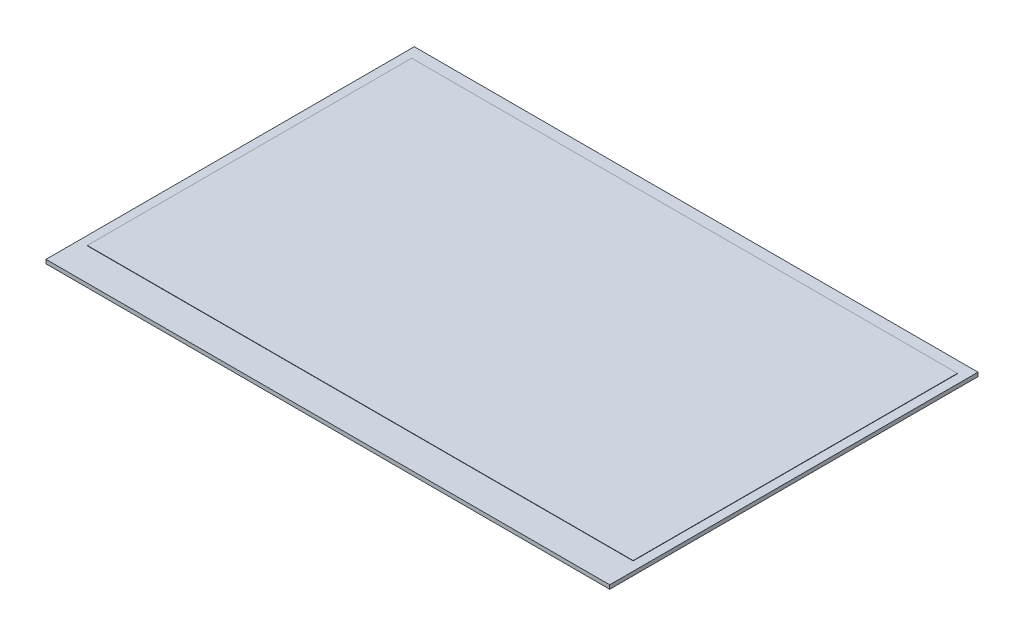
ISO-10303-21;
HEADER;
FILE_DESCRIPTION(('STEP AP214'),'2;1');
FILE_NAME('part.step','',(''),(''),'','','');
FILE_SCHEMA(('AUTOMOTIVE_DESIGN { 1 0 10303 214 1 1 1 1 }'));
ENDSEC;
DATA;
#1=APPLICATION_CONTEXT('core data for automotive mechanical design processes');
#2=APPLICATION_PROTOCOL_DEFINITION('international standard','automotive_design',2000,#1);
#3=PRODUCT_CONTEXT('',#1,'mechanical');
#4=PRODUCT('Part','Part','',(#3));
#5=PRODUCT_RELATED_PRODUCT_CATEGORY('part','',(#4));
#6=PRODUCT_DEFINITION_FORMATION('','',#4);
#7=PRODUCT_DEFINITION_CONTEXT('part definition',#1,'design');
#8=PRODUCT_DEFINITION('design','',#6,#7);
#9=PRODUCT_DEFINITION_SHAPE('','',#8);
#10=(LENGTH_UNIT() NAMED_UNIT(*) SI_UNIT(.MILLI.,.METRE.));
#11=(NAMED_UNIT(*) PLANE_ANGLE_UNIT() SI_UNIT($,.RADIAN.));
#12=(NAMED_UNIT(*) SI_UNIT($,.STERADIAN.) SOLID_ANGLE_UNIT());
#13=UNCERTAINTY_MEASURE_WITH_UNIT(LENGTH_MEASURE(1.E-05),#10,'distance_accuracy_value','');
#14=(GEOMETRIC_REPRESENTATION_CONTEXT(3) GLOBAL_UNCERTAINTY_ASSIGNED_CONTEXT((#13)) GLOBAL_UNIT_ASSIGNED_CONTEXT((#10,
#11,#12)) REPRESENTATION_CONTEXT('',''));
#15=CARTESIAN_POINT('',(0.,0.,0.));
#16=DIRECTION('',(0.,0.,1.));
#17=DIRECTION('',(1.,0.,0.));
#18=AXIS2_PLACEMENT_3D('',#15,#16,#17);
#19=CARTESIAN_POINT('',(85.1,1.18,-55.6));
#20=DIRECTION('',(-1.,0.,0.));
#21=DIRECTION('',(0.,0.,1.));
#22=AXIS2_PLACEMENT_3D('',#19,#20,#21);
#23=PLANE('',#22);
#24=DIRECTION('',(0.,0.,-1.));
#25=VECTOR('',#24,1.);
#26=CARTESIAN_POINT('',(85.1,0.,-55.6));
#27=LINE('',#26,#25);
#28=CARTESIAN_POINT('',(85.1,0.,55.6));
#29=VERTEX_POINT('',#28);
#30=CARTESIAN_POINT('',(85.1,0.,-55.6));
#31=VERTEX_POINT('',#30);
#32=EDGE_CURVE('E117',#29,#31,#27,.T.);
#33=ORIENTED_EDGE('',*,*,#32,.T.);
#34=DIRECTION('',(0.,-1.,0.));
#35=VECTOR('',#34,1.);
#36=CARTESIAN_POINT('',(85.1,1.18,-55.6));
#37=LINE('',#36,#35);
#38=CARTESIAN_POINT('',(85.1,1.18,-55.6));
#39=VERTEX_POINT('',#38);
#40=EDGE_CURVE('E11',#39,#31,#37,.T.);
#41=ORIENTED_EDGE('',*,*,#40,.F.);
#42=DIRECTION('',(0.,0.,-1.));
#43=VECTOR('',#42,1.);
#44=CARTESIAN_POINT('',(85.1,1.18,-55.6));
#45=LINE('',#44,#43);
#46=CARTESIAN_POINT('',(85.1,1.18,55.6));
#47=VERTEX_POINT('',#46);
#48=EDGE_CURVE('E126',#47,#39,#45,.T.);
#49=ORIENTED_EDGE('',*,*,#48,.F.);
#50=DIRECTION('',(0.,-1.,0.));
#51=VECTOR('',#50,1.);
#52=CARTESIAN_POINT('',(85.1,1.18,55.6));
#53=LINE('',#52,#51);
#54=EDGE_CURVE('E135',#47,#29,#53,.T.);
#55=ORIENTED_EDGE('',*,*,#54,.T.);
#56=EDGE_LOOP('',(#33,#41,#49,#55));
#57=FACE_BOUND('',#56,.T.);
#58=ADVANCED_FACE('F33',(#57),#23,.F.);
#59=CARTESIAN_POINT('',(-85.1,1.18,-55.6));
#60=DIRECTION('',(0.,0.,1.));
#61=DIRECTION('',(1.,0.,0.));
#62=AXIS2_PLACEMENT_3D('',#59,#60,#61);
#63=PLANE('',#62);
#64=DIRECTION('',(-1.,0.,0.));
#65=VECTOR('',#64,1.);
#66=CARTESIAN_POINT('',(-85.1,0.,-55.6));
#67=LINE('',#66,#65);
#68=CARTESIAN_POINT('',(-85.1,0.,-55.6));
#69=VERTEX_POINT('',#68);
#70=EDGE_CURVE('E120',#31,#69,#67,.T.);
#71=ORIENTED_EDGE('',*,*,#70,.T.);
#72=DIRECTION('',(0.,-1.,0.));
#73=VECTOR('',#72,1.);
#74=CARTESIAN_POINT('',(-85.1,1.18,-55.6));
#75=LINE('',#74,#73);
#76=CARTESIAN_POINT('',(-85.1,1.18,-55.6));
#77=VERTEX_POINT('',#76);
#78=EDGE_CURVE('E40',#77,#69,#75,.T.);
#79=ORIENTED_EDGE('',*,*,#78,.F.);
#80=DIRECTION('',(-1.,0.,0.));
#81=VECTOR('',#80,1.);
#82=CARTESIAN_POINT('',(-85.1,1.18,-55.6));
#83=LINE('',#82,#81);
#84=EDGE_CURVE('E129',#39,#77,#83,.T.);
#85=ORIENTED_EDGE('',*,*,#84,.F.);
#86=ORIENTED_EDGE('',*,*,#40,.T.);
#87=EDGE_LOOP('',(#71,#79,#85,#86));
#88=FACE_BOUND('',#87,.T.);
#89=ADVANCED_FACE('F166',(#88),#63,.F.);
#90=CARTESIAN_POINT('',(-85.1,1.18,-55.6));
#91=DIRECTION('',(1.,0.,0.));
#92=DIRECTION('',(0.,0.,-1.));
#93=AXIS2_PLACEMENT_3D('',#90,#91,#92);
#94=PLANE('',#93);
#95=DIRECTION('',(0.,0.,1.));
#96=VECTOR('',#95,1.);
#97=CARTESIAN_POINT('',(-85.1,0.,-55.6));
#98=LINE('',#97,#96);
#99=CARTESIAN_POINT('',(-85.1,0.,55.6));
#100=VERTEX_POINT('',#99);
#101=EDGE_CURVE('E138',#69,#100,#98,.T.);
#102=ORIENTED_EDGE('',*,*,#101,.T.);
#103=DIRECTION('',(0.,-1.,0.));
#104=VECTOR('',#103,1.);
#105=CARTESIAN_POINT('',(-85.1,1.18,55.6));
#106=LINE('',#105,#104);
#107=CARTESIAN_POINT('',(-85.1,1.18,55.6));
#108=VERTEX_POINT('',#107);
#109=EDGE_CURVE('E143',#108,#100,#106,.T.);
#110=ORIENTED_EDGE('',*,*,#109,.F.);
#111=DIRECTION('',(0.,0.,1.));
#112=VECTOR('',#111,1.);
#113=CARTESIAN_POINT('',(-85.1,1.18,-55.6));
#114=LINE('',#113,#112);
#115=EDGE_CURVE('E132',#77,#108,#114,.T.);
#116=ORIENTED_EDGE('',*,*,#115,.F.);
#117=ORIENTED_EDGE('',*,*,#78,.T.);
#118=EDGE_LOOP('',(#102,#110,#116,#117));
#119=FACE_BOUND('',#118,.T.);
#120=ADVANCED_FACE('F150',(#119),#94,.F.);
#121=CARTESIAN_POINT('',(-85.1,1.18,55.6));
#122=DIRECTION('',(0.,0.,-1.));
#123=DIRECTION('',(-1.,0.,0.));
#124=AXIS2_PLACEMENT_3D('',#121,#122,#123);
#125=PLANE('',#124);
#126=DIRECTION('',(1.,0.,0.));
#127=VECTOR('',#126,1.);
#128=CARTESIAN_POINT('',(-85.1,0.,55.6));
#129=LINE('',#128,#127);
#130=EDGE_CURVE('E130',#100,#29,#129,.T.);
#131=ORIENTED_EDGE('',*,*,#130,.T.);
#132=ORIENTED_EDGE('',*,*,#54,.F.);
#133=DIRECTION('',(1.,0.,0.));
#134=VECTOR('',#133,1.);
#135=CARTESIAN_POINT('',(-85.1,1.18,55.6));
#136=LINE('',#135,#134);
#137=EDGE_CURVE('E134',#108,#47,#136,.T.);
#138=ORIENTED_EDGE('',*,*,#137,.F.);
#139=ORIENTED_EDGE('',*,*,#109,.T.);
#140=EDGE_LOOP('',(#131,#132,#138,#139));
#141=FACE_BOUND('',#140,.T.);
#142=ADVANCED_FACE('F159',(#141),#125,.F.);
#143=CARTESIAN_POINT('',(0.,1.18,0.));
#144=DIRECTION('',(0.,1.,0.));
#145=DIRECTION('',(0.,0.,1.));
#146=AXIS2_PLACEMENT_3D('',#143,#144,#145);
#147=PLANE('',#146);
#148=DIRECTION('',(0.,0.,-1.));
#149=VECTOR('',#148,1.);
#150=CARTESIAN_POINT('',(82.4,1.18,-52.1));
#151=LINE('',#150,#149);
#152=CARTESIAN_POINT('',(82.4,1.18,45.82));
#153=VERTEX_POINT('',#152);
#154=CARTESIAN_POINT('',(82.4,1.18,-52.1));
#155=VERTEX_POINT('',#154);
#156=EDGE_CURVE('E47',#153,#155,#151,.T.);
#157=ORIENTED_EDGE('',*,*,#156,.F.);
#158=DIRECTION('',(1.,0.,0.));
#159=VECTOR('',#158,1.);
#160=CARTESIAN_POINT('',(-82.4,1.18,45.82));
#161=LINE('',#160,#159);
#162=CARTESIAN_POINT('',(-82.4,1.18,45.82));
#163=VERTEX_POINT('',#162);
#164=EDGE_CURVE('E51',#163,#153,#161,.T.);
#165=ORIENTED_EDGE('',*,*,#164,.F.);
#166=DIRECTION('',(0.,0.,1.));
#167=VECTOR('',#166,1.);
#168=CARTESIAN_POINT('',(-82.4,1.18,-52.1));
#169=LINE('',#168,#167);
#170=CARTESIAN_POINT('',(-82.4,1.18,-52.1));
#171=VERTEX_POINT('',#170);
#172=EDGE_CURVE('E260',#171,#163,#169,.T.);
#173=ORIENTED_EDGE('',*,*,#172,.F.);
#174=DIRECTION('',(-1.,0.,0.));
#175=VECTOR('',#174,1.);
#176=CARTESIAN_POINT('',(-82.4,1.18,-52.1));
#177=LINE('',#176,#175);
#178=EDGE_CURVE('E266',#155,#171,#177,.T.);
#179=ORIENTED_EDGE('',*,*,#178,.F.);
#180=EDGE_LOOP('',(#157,#165,#173,#179));
#181=FACE_BOUND('',#180,.T.);
#182=ORIENTED_EDGE('',*,*,#48,.T.);
#183=ORIENTED_EDGE('',*,*,#84,.T.);
#184=ORIENTED_EDGE('',*,*,#115,.T.);
#185=ORIENTED_EDGE('',*,*,#137,.T.);
#186=EDGE_LOOP('',(#182,#183,#184,#185));
#187=FACE_BOUND('',#186,.T.);
#188=ADVANCED_FACE('F165',(#181,#187),#147,.T.);
#189=CARTESIAN_POINT('',(0.,0.,0.));
#190=DIRECTION('',(0.,1.,0.));
#191=DIRECTION('',(0.,0.,1.));
#192=AXIS2_PLACEMENT_3D('',#189,#190,#191);
#193=PLANE('',#192);
#194=ORIENTED_EDGE('',*,*,#32,.F.);
#195=ORIENTED_EDGE('',*,*,#130,.F.);
#196=ORIENTED_EDGE('',*,*,#101,.F.);
#197=ORIENTED_EDGE('',*,*,#70,.F.);
#198=EDGE_LOOP('',(#194,#195,#196,#197));
#199=FACE_BOUND('',#198,.T.);
#200=ADVANCED_FACE('F156',(#199),#193,.F.);
#201=CARTESIAN_POINT('',(82.4,1.28,-52.1));
#202=DIRECTION('',(-1.,0.,0.));
#203=DIRECTION('',(0.,0.,1.));
#204=AXIS2_PLACEMENT_3D('',#201,#202,#203);
#205=PLANE('',#204);
#206=ORIENTED_EDGE('',*,*,#156,.T.);
#207=DIRECTION('',(0.,-1.,0.));
#208=VECTOR('',#207,1.);
#209=CARTESIAN_POINT('',(82.4,1.28,-52.1));
#210=LINE('',#209,#208);
#211=CARTESIAN_POINT('',(82.4,1.28,-52.1));
#212=VERTEX_POINT('',#211);
#213=EDGE_CURVE('E100',#212,#155,#210,.T.);
#214=ORIENTED_EDGE('',*,*,#213,.F.);
#215=DIRECTION('',(0.,0.,-1.));
#216=VECTOR('',#215,1.);
#217=CARTESIAN_POINT('',(82.4,1.28,-52.1));
#218=LINE('',#217,#216);
#219=CARTESIAN_POINT('',(82.4,1.28,45.82));
#220=VERTEX_POINT('',#219);
#221=EDGE_CURVE('E106',#220,#212,#218,.T.);
#222=ORIENTED_EDGE('',*,*,#221,.F.);
#223=DIRECTION('',(0.,-1.,0.));
#224=VECTOR('',#223,1.);
#225=CARTESIAN_POINT('',(82.4,1.28,45.82));
#226=LINE('',#225,#224);
#227=EDGE_CURVE('E258',#220,#153,#226,.T.);
#228=ORIENTED_EDGE('',*,*,#227,.T.);
#229=EDGE_LOOP('',(#206,#214,#222,#228));
#230=FACE_BOUND('',#229,.T.);
#231=ADVANCED_FACE('F116',(#230),#205,.F.);
#232=CARTESIAN_POINT('',(-82.4,1.28,-52.1));
#233=DIRECTION('',(0.,0.,1.));
#234=DIRECTION('',(1.,0.,0.));
#235=AXIS2_PLACEMENT_3D('',#232,#233,#234);
#236=PLANE('',#235);
#237=ORIENTED_EDGE('',*,*,#178,.T.);
#238=DIRECTION('',(0.,-1.,0.));
#239=VECTOR('',#238,1.);
#240=CARTESIAN_POINT('',(-82.4,1.28,-52.1));
#241=LINE('',#240,#239);
#242=CARTESIAN_POINT('',(-82.4,1.28,-52.1));
#243=VERTEX_POINT('',#242);
#244=EDGE_CURVE('E102',#243,#171,#241,.T.);
#245=ORIENTED_EDGE('',*,*,#244,.F.);
#246=DIRECTION('',(-1.,0.,0.));
#247=VECTOR('',#246,1.);
#248=CARTESIAN_POINT('',(-82.4,1.28,-52.1));
#249=LINE('',#248,#247);
#250=EDGE_CURVE('E95',#212,#243,#249,.T.);
#251=ORIENTED_EDGE('',*,*,#250,.F.);
#252=ORIENTED_EDGE('',*,*,#213,.T.);
#253=EDGE_LOOP('',(#237,#245,#251,#252));
#254=FACE_BOUND('',#253,.T.);
#255=ADVANCED_FACE('F98',(#254),#236,.F.);
#256=CARTESIAN_POINT('',(-82.4,1.28,-52.1));
#257=DIRECTION('',(1.,0.,0.));
#258=DIRECTION('',(0.,0.,-1.));
#259=AXIS2_PLACEMENT_3D('',#256,#257,#258);
#260=PLANE('',#259);
#261=ORIENTED_EDGE('',*,*,#172,.T.);
#262=DIRECTION('',(0.,-1.,0.));
#263=VECTOR('',#262,1.);
#264=CARTESIAN_POINT('',(-82.4,1.28,45.82));
#265=LINE('',#264,#263);
#266=CARTESIAN_POINT('',(-82.4,1.28,45.82));
#267=VERTEX_POINT('',#266);
#268=EDGE_CURVE('E122',#267,#163,#265,.T.);
#269=ORIENTED_EDGE('',*,*,#268,.F.);
#270=DIRECTION('',(0.,0.,1.));
#271=VECTOR('',#270,1.);
#272=CARTESIAN_POINT('',(-82.4,1.28,-52.1));
#273=LINE('',#272,#271);
#274=EDGE_CURVE('E105',#243,#267,#273,.T.);
#275=ORIENTED_EDGE('',*,*,#274,.F.);
#276=ORIENTED_EDGE('',*,*,#244,.T.);
#277=EDGE_LOOP('',(#261,#269,#275,#276));
#278=FACE_BOUND('',#277,.T.);
#279=ADVANCED_FACE('F184',(#278),#260,.F.);
#280=CARTESIAN_POINT('',(-82.4,1.28,45.82));
#281=DIRECTION('',(0.,0.,-1.));
#282=DIRECTION('',(-1.,0.,0.));
#283=AXIS2_PLACEMENT_3D('',#280,#281,#282);
#284=PLANE('',#283);
#285=ORIENTED_EDGE('',*,*,#164,.T.);
#286=ORIENTED_EDGE('',*,*,#227,.F.);
#287=DIRECTION('',(1.,0.,0.));
#288=VECTOR('',#287,1.);
#289=CARTESIAN_POINT('',(-82.4,1.28,45.82));
#290=LINE('',#289,#288);
#291=EDGE_CURVE('E111',#267,#220,#290,.T.);
#292=ORIENTED_EDGE('',*,*,#291,.F.);
#293=ORIENTED_EDGE('',*,*,#268,.T.);
#294=EDGE_LOOP('',(#285,#286,#292,#293));
#295=FACE_BOUND('',#294,.T.);
#296=ADVANCED_FACE('F187',(#295),#284,.F.);
#297=CARTESIAN_POINT('',(0.,1.28,0.));
#298=DIRECTION('',(0.,1.,0.));
#299=DIRECTION('',(0.,0.,1.));
#300=AXIS2_PLACEMENT_3D('',#297,#298,#299);
#301=PLANE('',#300);
#302=ORIENTED_EDGE('',*,*,#221,.T.);
#303=ORIENTED_EDGE('',*,*,#250,.T.);
#304=ORIENTED_EDGE('',*,*,#274,.T.);
#305=ORIENTED_EDGE('',*,*,#291,.T.);
#306=EDGE_LOOP('',(#302,#303,#304,#305));
#307=FACE_BOUND('',#306,.T.);
#308=ADVANCED_FACE('F109',(#307),#301,.T.);
#309=CLOSED_SHELL('',(#58,#89,#120,#142,#188,#200,#231,#255,#279,#296,#308));
#310=MANIFOLD_SOLID_BREP('B2',#309);
#311=ADVANCED_BREP_SHAPE_REPRESENTATION('',(#18,#310),#14);
#312=SHAPE_DEFINITION_REPRESENTATION(#9,#311);
ENDSEC;
END-ISO-10303-21;
